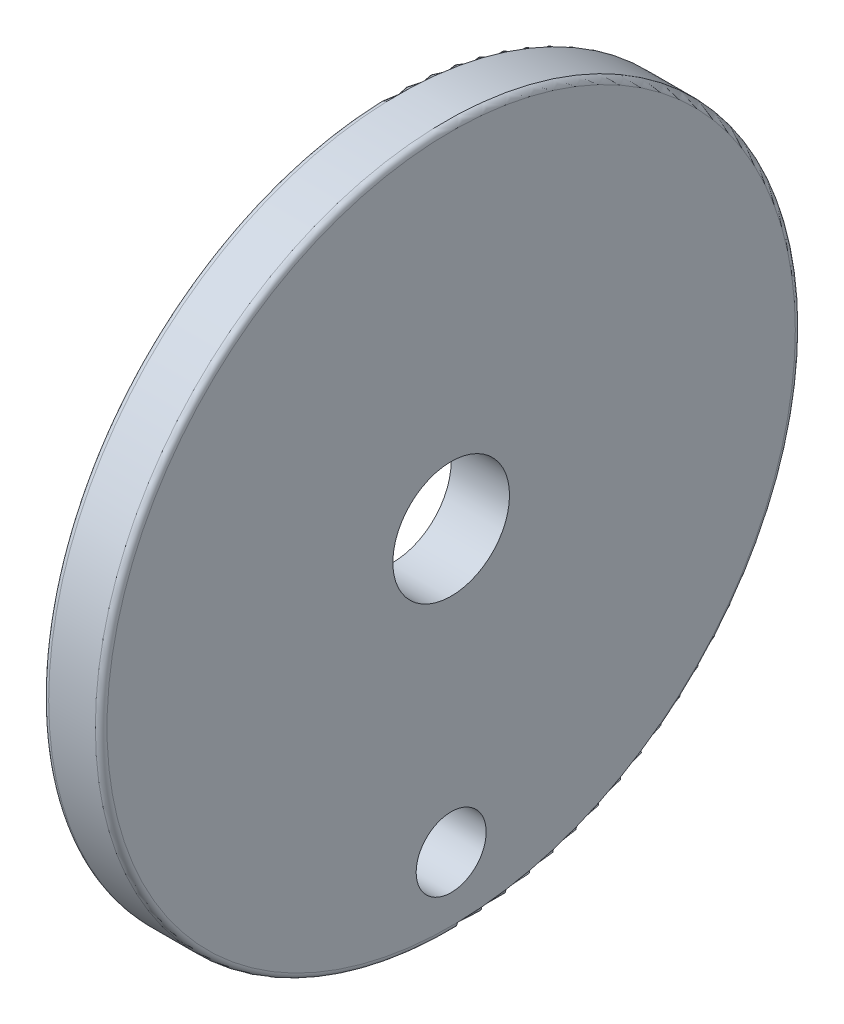
ISO-10303-21;
HEADER;
FILE_DESCRIPTION(('STEP AP214'),'2;1');
FILE_NAME('part.step','',(''),(''),'','','');
FILE_SCHEMA(('AUTOMOTIVE_DESIGN { 1 0 10303 214 1 1 1 1 }'));
ENDSEC;
DATA;
#1=APPLICATION_CONTEXT('core data for automotive mechanical design processes');
#2=APPLICATION_PROTOCOL_DEFINITION('international standard','automotive_design',2000,#1);
#3=PRODUCT_CONTEXT('',#1,'mechanical');
#4=PRODUCT('Part','Part','',(#3));
#5=PRODUCT_RELATED_PRODUCT_CATEGORY('part','',(#4));
#6=PRODUCT_DEFINITION_FORMATION('','',#4);
#7=PRODUCT_DEFINITION_CONTEXT('part definition',#1,'design');
#8=PRODUCT_DEFINITION('design','',#6,#7);
#9=PRODUCT_DEFINITION_SHAPE('','',#8);
#10=(LENGTH_UNIT() NAMED_UNIT(*) SI_UNIT(.MILLI.,.METRE.));
#11=(NAMED_UNIT(*) PLANE_ANGLE_UNIT() SI_UNIT($,.RADIAN.));
#12=(NAMED_UNIT(*) SI_UNIT($,.STERADIAN.) SOLID_ANGLE_UNIT());
#13=UNCERTAINTY_MEASURE_WITH_UNIT(LENGTH_MEASURE(1.E-05),#10,'distance_accuracy_value','');
#14=(GEOMETRIC_REPRESENTATION_CONTEXT(3) GLOBAL_UNCERTAINTY_ASSIGNED_CONTEXT((#13)) GLOBAL_UNIT_ASSIGNED_CONTEXT((#10,
#11,#12)) REPRESENTATION_CONTEXT('',''));
#15=CARTESIAN_POINT('',(0.,0.,0.));
#16=DIRECTION('',(0.,0.,1.));
#17=DIRECTION('',(1.,0.,0.));
#18=AXIS2_PLACEMENT_3D('',#15,#16,#17);
#19=CARTESIAN_POINT('',(5.,0.,0.));
#20=DIRECTION('',(1.,0.,0.));
#21=DIRECTION('',(0.,0.,-1.));
#22=AXIS2_PLACEMENT_3D('',#19,#20,#21);
#23=PLANE('',#22);
#24=CARTESIAN_POINT('',(5.,0.,0.));
#25=DIRECTION('',(1.,0.,0.));
#26=DIRECTION('',(0.,0.,-1.));
#27=AXIS2_PLACEMENT_3D('',#24,#25,#26);
#28=CIRCLE('',#27,29.5);
#29=CARTESIAN_POINT('',(5.,0.,-29.5));
#30=VERTEX_POINT('',#29);
#31=EDGE_CURVE('E10',#30,#30,#28,.T.);
#32=ORIENTED_EDGE('',*,*,#31,.T.);
#33=EDGE_LOOP('',(#32));
#34=FACE_BOUND('',#33,.T.);
#35=CARTESIAN_POINT('',(5.,-24.,0.));
#36=DIRECTION('',(1.,0.,0.));
#37=DIRECTION('',(0.,0.,-1.));
#38=AXIS2_PLACEMENT_3D('',#35,#36,#37);
#39=CIRCLE('',#38,3.);
#40=CARTESIAN_POINT('',(5.,-24.,-3.));
#41=VERTEX_POINT('',#40);
#42=EDGE_CURVE('E60',#41,#41,#39,.F.);
#43=ORIENTED_EDGE('',*,*,#42,.T.);
#44=EDGE_LOOP('',(#43));
#45=FACE_BOUND('',#44,.T.);
#46=CARTESIAN_POINT('',(5.,0.,0.));
#47=DIRECTION('',(1.,0.,0.));
#48=DIRECTION('',(0.,0.,-1.));
#49=AXIS2_PLACEMENT_3D('',#46,#47,#48);
#50=CIRCLE('',#49,5.);
#51=CARTESIAN_POINT('',(5.,0.,-5.));
#52=VERTEX_POINT('',#51);
#53=EDGE_CURVE('E53',#52,#52,#50,.T.);
#54=ORIENTED_EDGE('',*,*,#53,.F.);
#55=EDGE_LOOP('',(#54));
#56=FACE_BOUND('',#55,.T.);
#57=ADVANCED_FACE('F33',(#34,#45,#56),#23,.T.);
#58=CARTESIAN_POINT('',(0.,0.,0.));
#59=DIRECTION('',(1.,0.,0.));
#60=DIRECTION('',(0.,0.,-1.));
#61=AXIS2_PLACEMENT_3D('',#58,#59,#60);
#62=PLANE('',#61);
#63=CARTESIAN_POINT('',(0.,0.,0.));
#64=DIRECTION('',(1.,0.,0.));
#65=DIRECTION('',(0.,0.,-1.));
#66=AXIS2_PLACEMENT_3D('',#63,#64,#65);
#67=CIRCLE('',#66,29.5);
#68=CARTESIAN_POINT('',(0.,0.,-29.5));
#69=VERTEX_POINT('',#68);
#70=EDGE_CURVE('E40',#69,#69,#67,.F.);
#71=ORIENTED_EDGE('',*,*,#70,.T.);
#72=EDGE_LOOP('',(#71));
#73=FACE_BOUND('',#72,.T.);
#74=CARTESIAN_POINT('',(0.,-24.,0.));
#75=DIRECTION('',(-1.,0.,0.));
#76=DIRECTION('',(0.,0.,1.));
#77=AXIS2_PLACEMENT_3D('',#74,#75,#76);
#78=CIRCLE('',#77,3.);
#79=CARTESIAN_POINT('',(0.,-24.,3.));
#80=VERTEX_POINT('',#79);
#81=EDGE_CURVE('E57',#80,#80,#78,.T.);
#82=ORIENTED_EDGE('',*,*,#81,.F.);
#83=EDGE_LOOP('',(#82));
#84=FACE_BOUND('',#83,.T.);
#85=CARTESIAN_POINT('',(0.,0.,0.));
#86=DIRECTION('',(1.,0.,0.));
#87=DIRECTION('',(0.,0.,-1.));
#88=AXIS2_PLACEMENT_3D('',#85,#86,#87);
#89=CIRCLE('',#88,5.);
#90=CARTESIAN_POINT('',(0.,0.,-5.));
#91=VERTEX_POINT('',#90);
#92=EDGE_CURVE('E54',#91,#91,#89,.T.);
#93=ORIENTED_EDGE('',*,*,#92,.T.);
#94=EDGE_LOOP('',(#93));
#95=FACE_BOUND('',#94,.T.);
#96=ADVANCED_FACE('F68',(#73,#84,#95),#62,.F.);
#97=CARTESIAN_POINT('',(5.,0.,0.));
#98=DIRECTION('',(-1.,0.,0.));
#99=DIRECTION('',(0.,0.,1.));
#100=AXIS2_PLACEMENT_3D('',#97,#98,#99);
#101=CYLINDRICAL_SURFACE('',#100,30.);
#102=CARTESIAN_POINT('',(0.5,0.,0.));
#103=DIRECTION('',(1.,0.,0.));
#104=DIRECTION('',(0.,0.,-1.));
#105=AXIS2_PLACEMENT_3D('',#102,#103,#104);
#106=CIRCLE('',#105,30.);
#107=CARTESIAN_POINT('',(0.5,0.,-30.));
#108=VERTEX_POINT('',#107);
#109=EDGE_CURVE('E44',#108,#108,#106,.T.);
#110=ORIENTED_EDGE('',*,*,#109,.T.);
#111=EDGE_LOOP('',(#110));
#112=FACE_BOUND('',#111,.T.);
#113=CARTESIAN_POINT('',(4.5,0.,0.));
#114=DIRECTION('',(1.,0.,0.));
#115=DIRECTION('',(0.,0.,-1.));
#116=AXIS2_PLACEMENT_3D('',#113,#114,#115);
#117=CIRCLE('',#116,30.);
#118=CARTESIAN_POINT('',(4.5,0.,-30.));
#119=VERTEX_POINT('',#118);
#120=EDGE_CURVE('E48',#119,#119,#117,.F.);
#121=ORIENTED_EDGE('',*,*,#120,.T.);
#122=EDGE_LOOP('',(#121));
#123=FACE_BOUND('',#122,.T.);
#124=ADVANCED_FACE('F71',(#112,#123),#101,.T.);
#125=CARTESIAN_POINT('',(5.,0.,0.));
#126=DIRECTION('',(-1.,0.,0.));
#127=DIRECTION('',(0.,0.,1.));
#128=AXIS2_PLACEMENT_3D('',#125,#126,#127);
#129=CYLINDRICAL_SURFACE('',#128,5.);
#130=ORIENTED_EDGE('',*,*,#53,.T.);
#131=EDGE_LOOP('',(#130));
#132=FACE_BOUND('',#131,.T.);
#133=ORIENTED_EDGE('',*,*,#92,.F.);
#134=EDGE_LOOP('',(#133));
#135=FACE_BOUND('',#134,.T.);
#136=ADVANCED_FACE('F75',(#132,#135),#129,.F.);
#137=CARTESIAN_POINT('',(5.001,-24.,0.));
#138=DIRECTION('',(-1.,0.,0.));
#139=DIRECTION('',(0.,0.,1.));
#140=AXIS2_PLACEMENT_3D('',#137,#138,#139);
#141=CYLINDRICAL_SURFACE('',#140,3.);
#142=ORIENTED_EDGE('',*,*,#42,.F.);
#143=EDGE_LOOP('',(#142));
#144=FACE_BOUND('',#143,.T.);
#145=ORIENTED_EDGE('',*,*,#81,.T.);
#146=EDGE_LOOP('',(#145));
#147=FACE_BOUND('',#146,.T.);
#148=ADVANCED_FACE('F66',(#144,#147),#141,.F.);
#149=CARTESIAN_POINT('',(0.5,0.,0.));
#150=DIRECTION('',(1.,0.,0.));
#151=DIRECTION('',(0.,0.,-1.));
#152=AXIS2_PLACEMENT_3D('',#149,#150,#151);
#153=TOROIDAL_SURFACE('',#152,29.5,0.5);
#154=ORIENTED_EDGE('',*,*,#70,.F.);
#155=EDGE_LOOP('',(#154));
#156=FACE_BOUND('',#155,.T.);
#157=ORIENTED_EDGE('',*,*,#109,.F.);
#158=EDGE_LOOP('',(#157));
#159=FACE_BOUND('',#158,.T.);
#160=ADVANCED_FACE('F83',(#156,#159),#153,.T.);
#161=CARTESIAN_POINT('',(4.5,0.,0.));
#162=DIRECTION('',(1.,0.,0.));
#163=DIRECTION('',(0.,0.,-1.));
#164=AXIS2_PLACEMENT_3D('',#161,#162,#163);
#165=TOROIDAL_SURFACE('',#164,29.5,0.5);
#166=ORIENTED_EDGE('',*,*,#120,.F.);
#167=EDGE_LOOP('',(#166));
#168=FACE_BOUND('',#167,.T.);
#169=ORIENTED_EDGE('',*,*,#31,.F.);
#170=EDGE_LOOP('',(#169));
#171=FACE_BOUND('',#170,.T.);
#172=ADVANCED_FACE('F35',(#168,#171),#165,.T.);
#173=CLOSED_SHELL('',(#57,#96,#124,#136,#148,#160,#172));
#174=MANIFOLD_SOLID_BREP('B2',#173);
#175=ADVANCED_BREP_SHAPE_REPRESENTATION('',(#18,#174),#14);
#176=SHAPE_DEFINITION_REPRESENTATION(#9,#175);
ENDSEC;
END-ISO-10303-21;
